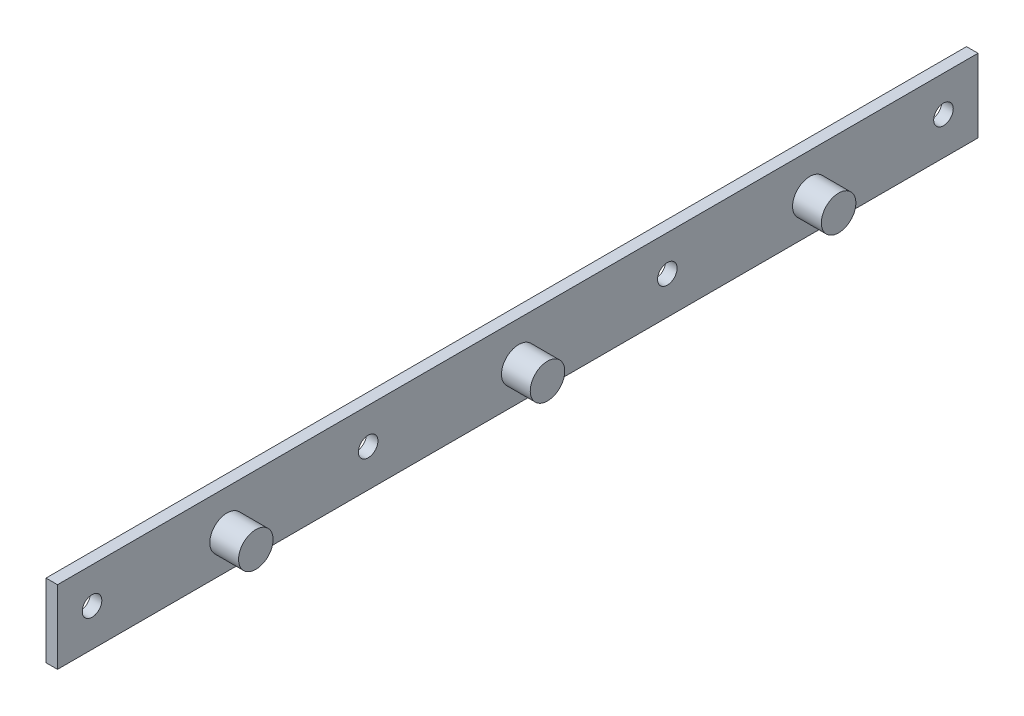
ISO-10303-21;
HEADER;
FILE_DESCRIPTION(('STEP AP214'),'2;1');
FILE_NAME('part.step','',(''),(''),'','','');
FILE_SCHEMA(('AUTOMOTIVE_DESIGN { 1 0 10303 214 1 1 1 1 }'));
ENDSEC;
DATA;
#1=APPLICATION_CONTEXT('core data for automotive mechanical design processes');
#2=APPLICATION_PROTOCOL_DEFINITION('international standard','automotive_design',2000,#1);
#3=PRODUCT_CONTEXT('',#1,'mechanical');
#4=PRODUCT('Part','Part','',(#3));
#5=PRODUCT_RELATED_PRODUCT_CATEGORY('part','',(#4));
#6=PRODUCT_DEFINITION_FORMATION('','',#4);
#7=PRODUCT_DEFINITION_CONTEXT('part definition',#1,'design');
#8=PRODUCT_DEFINITION('design','',#6,#7);
#9=PRODUCT_DEFINITION_SHAPE('','',#8);
#10=(LENGTH_UNIT() NAMED_UNIT(*) SI_UNIT(.MILLI.,.METRE.));
#11=(NAMED_UNIT(*) PLANE_ANGLE_UNIT() SI_UNIT($,.RADIAN.));
#12=(NAMED_UNIT(*) SI_UNIT($,.STERADIAN.) SOLID_ANGLE_UNIT());
#13=UNCERTAINTY_MEASURE_WITH_UNIT(LENGTH_MEASURE(1.E-05),#10,'distance_accuracy_value','');
#14=(GEOMETRIC_REPRESENTATION_CONTEXT(3) GLOBAL_UNCERTAINTY_ASSIGNED_CONTEXT((#13)) GLOBAL_UNIT_ASSIGNED_CONTEXT((#10,
#11,#12)) REPRESENTATION_CONTEXT('',''));
#15=CARTESIAN_POINT('',(0.,0.,0.));
#16=DIRECTION('',(0.,0.,1.));
#17=DIRECTION('',(1.,0.,0.));
#18=AXIS2_PLACEMENT_3D('',#15,#16,#17);
#19=CARTESIAN_POINT('',(2.,0.,0.));
#20=DIRECTION('',(-1.,0.,0.));
#21=DIRECTION('',(0.,0.,1.));
#22=AXIS2_PLACEMENT_3D('',#19,#20,#21);
#23=PLANE('',#22);
#24=CARTESIAN_POINT('',(2.,-0.555,-50.77));
#25=DIRECTION('',(-1.,0.,0.));
#26=DIRECTION('',(0.,0.,1.));
#27=AXIS2_PLACEMENT_3D('',#24,#25,#26);
#28=CIRCLE('',#27,3.);
#29=CARTESIAN_POINT('',(2.,-0.555,-47.77));
#30=VERTEX_POINT('',#29);
#31=EDGE_CURVE('E44',#30,#30,#28,.F.);
#32=ORIENTED_EDGE('',*,*,#31,.F.);
#33=EDGE_LOOP('',(#32));
#34=FACE_BOUND('',#33,.T.);
#35=CARTESIAN_POINT('',(2.,0.174999999999999,-74.));
#36=DIRECTION('',(1.,0.,0.));
#37=DIRECTION('',(0.,0.,-1.));
#38=AXIS2_PLACEMENT_3D('',#35,#36,#37);
#39=CIRCLE('',#38,1.7);
#40=CARTESIAN_POINT('',(2.,0.174999999999999,-75.7));
#41=VERTEX_POINT('',#40);
#42=EDGE_CURVE('E127',#41,#41,#39,.T.);
#43=ORIENTED_EDGE('',*,*,#42,.F.);
#44=EDGE_LOOP('',(#43));
#45=FACE_BOUND('',#44,.T.);
#46=CARTESIAN_POINT('',(2.,0.174999999999999,26.));
#47=DIRECTION('',(1.,0.,0.));
#48=DIRECTION('',(0.,0.,-1.));
#49=AXIS2_PLACEMENT_3D('',#46,#47,#48);
#50=CIRCLE('',#49,1.7);
#51=CARTESIAN_POINT('',(2.,0.174999999999999,24.3));
#52=VERTEX_POINT('',#51);
#53=EDGE_CURVE('E130',#52,#52,#50,.T.);
#54=ORIENTED_EDGE('',*,*,#53,.F.);
#55=EDGE_LOOP('',(#54));
#56=FACE_BOUND('',#55,.T.);
#57=DIRECTION('',(0.,1.,0.));
#58=VECTOR('',#57,1.);
#59=CARTESIAN_POINT('',(2.,-6.375,-80.));
#60=LINE('',#59,#58);
#61=CARTESIAN_POINT('',(2.,-6.375,-80.));
#62=VERTEX_POINT('',#61);
#63=CARTESIAN_POINT('',(2.,6.375,-80.));
#64=VERTEX_POINT('',#63);
#65=EDGE_CURVE('E88',#62,#64,#60,.T.);
#66=ORIENTED_EDGE('',*,*,#65,.T.);
#67=DIRECTION('',(0.,0.,1.));
#68=VECTOR('',#67,1.);
#69=CARTESIAN_POINT('',(2.,6.375,80.));
#70=LINE('',#69,#68);
#71=CARTESIAN_POINT('',(2.,6.375,80.));
#72=VERTEX_POINT('',#71);
#73=EDGE_CURVE('E83',#64,#72,#70,.T.);
#74=ORIENTED_EDGE('',*,*,#73,.T.);
#75=DIRECTION('',(0.,-1.,0.));
#76=VECTOR('',#75,1.);
#77=CARTESIAN_POINT('',(2.,-6.375,80.));
#78=LINE('',#77,#76);
#79=CARTESIAN_POINT('',(2.,-6.375,80.));
#80=VERTEX_POINT('',#79);
#81=EDGE_CURVE('E86',#72,#80,#78,.T.);
#82=ORIENTED_EDGE('',*,*,#81,.T.);
#83=DIRECTION('',(0.,0.,-1.));
#84=VECTOR('',#83,1.);
#85=CARTESIAN_POINT('',(2.,-6.375,80.));
#86=LINE('',#85,#84);
#87=EDGE_CURVE('E52',#80,#62,#86,.T.);
#88=ORIENTED_EDGE('',*,*,#87,.T.);
#89=EDGE_LOOP('',(#66,#74,#82,#88));
#90=FACE_BOUND('',#89,.T.);
#91=CARTESIAN_POINT('',(2.,0.174999999999999,74.));
#92=DIRECTION('',(1.,0.,0.));
#93=DIRECTION('',(0.,0.,-1.));
#94=AXIS2_PLACEMENT_3D('',#91,#92,#93);
#95=CIRCLE('',#94,1.7);
#96=CARTESIAN_POINT('',(2.,0.174999999999999,72.3));
#97=VERTEX_POINT('',#96);
#98=EDGE_CURVE('E106',#97,#97,#95,.T.);
#99=ORIENTED_EDGE('',*,*,#98,.F.);
#100=EDGE_LOOP('',(#99));
#101=FACE_BOUND('',#100,.T.);
#102=CARTESIAN_POINT('',(2.,0.174999999999999,-26.));
#103=DIRECTION('',(1.,0.,0.));
#104=DIRECTION('',(0.,0.,-1.));
#105=AXIS2_PLACEMENT_3D('',#102,#103,#104);
#106=CIRCLE('',#105,1.7);
#107=CARTESIAN_POINT('',(2.,0.174999999999999,-27.7));
#108=VERTEX_POINT('',#107);
#109=EDGE_CURVE('E138',#108,#108,#106,.T.);
#110=ORIENTED_EDGE('',*,*,#109,.F.);
#111=EDGE_LOOP('',(#110));
#112=FACE_BOUND('',#111,.T.);
#113=CARTESIAN_POINT('',(2.,-0.555,-0.170000000000003));
#114=DIRECTION('',(-1.,0.,0.));
#115=DIRECTION('',(0.,0.,1.));
#116=AXIS2_PLACEMENT_3D('',#113,#114,#115);
#117=CIRCLE('',#116,3.);
#118=CARTESIAN_POINT('',(2.,-0.555,2.83));
#119=VERTEX_POINT('',#118);
#120=EDGE_CURVE('E113',#119,#119,#117,.F.);
#121=ORIENTED_EDGE('',*,*,#120,.F.);
#122=EDGE_LOOP('',(#121));
#123=FACE_BOUND('',#122,.T.);
#124=CARTESIAN_POINT('',(2.,-0.555,50.53));
#125=DIRECTION('',(-1.,0.,0.));
#126=DIRECTION('',(0.,0.,1.));
#127=AXIS2_PLACEMENT_3D('',#124,#125,#126);
#128=CIRCLE('',#127,3.);
#129=CARTESIAN_POINT('',(2.,-0.555,53.53));
#130=VERTEX_POINT('',#129);
#131=EDGE_CURVE('E11',#130,#130,#128,.F.);
#132=ORIENTED_EDGE('',*,*,#131,.F.);
#133=EDGE_LOOP('',(#132));
#134=FACE_BOUND('',#133,.T.);
#135=ADVANCED_FACE('F35',(#34,#45,#56,#90,#101,#112,#123,#134),#23,.F.);
#136=CARTESIAN_POINT('',(0.,0.,0.));
#137=DIRECTION('',(-1.,0.,0.));
#138=DIRECTION('',(0.,0.,1.));
#139=AXIS2_PLACEMENT_3D('',#136,#137,#138);
#140=PLANE('',#139);
#141=CARTESIAN_POINT('',(0.,0.174999999999999,-26.));
#142=DIRECTION('',(1.,0.,0.));
#143=DIRECTION('',(0.,0.,-1.));
#144=AXIS2_PLACEMENT_3D('',#141,#142,#143);
#145=CIRCLE('',#144,1.7);
#146=CARTESIAN_POINT('',(0.,0.174999999999999,-27.7));
#147=VERTEX_POINT('',#146);
#148=EDGE_CURVE('E141',#147,#147,#145,.T.);
#149=ORIENTED_EDGE('',*,*,#148,.T.);
#150=EDGE_LOOP('',(#149));
#151=FACE_BOUND('',#150,.T.);
#152=CARTESIAN_POINT('',(0.,0.174999999999999,74.));
#153=DIRECTION('',(1.,0.,0.));
#154=DIRECTION('',(0.,0.,-1.));
#155=AXIS2_PLACEMENT_3D('',#152,#153,#154);
#156=CIRCLE('',#155,1.7);
#157=CARTESIAN_POINT('',(0.,0.174999999999999,72.3));
#158=VERTEX_POINT('',#157);
#159=EDGE_CURVE('E132',#158,#158,#156,.T.);
#160=ORIENTED_EDGE('',*,*,#159,.T.);
#161=EDGE_LOOP('',(#160));
#162=FACE_BOUND('',#161,.T.);
#163=DIRECTION('',(0.,1.,0.));
#164=VECTOR('',#163,1.);
#165=CARTESIAN_POINT('',(0.,-6.375,-80.));
#166=LINE('',#165,#164);
#167=CARTESIAN_POINT('',(0.,-6.375,-80.));
#168=VERTEX_POINT('',#167);
#169=CARTESIAN_POINT('',(0.,6.375,-80.));
#170=VERTEX_POINT('',#169);
#171=EDGE_CURVE('E103',#168,#170,#166,.T.);
#172=ORIENTED_EDGE('',*,*,#171,.F.);
#173=DIRECTION('',(0.,0.,-1.));
#174=VECTOR('',#173,1.);
#175=CARTESIAN_POINT('',(0.,-6.375,80.));
#176=LINE('',#175,#174);
#177=CARTESIAN_POINT('',(0.,-6.375,80.));
#178=VERTEX_POINT('',#177);
#179=EDGE_CURVE('E75',#178,#168,#176,.T.);
#180=ORIENTED_EDGE('',*,*,#179,.F.);
#181=DIRECTION('',(0.,-1.,0.));
#182=VECTOR('',#181,1.);
#183=CARTESIAN_POINT('',(0.,-6.375,80.));
#184=LINE('',#183,#182);
#185=CARTESIAN_POINT('',(0.,6.375,80.));
#186=VERTEX_POINT('',#185);
#187=EDGE_CURVE('E69',#186,#178,#184,.T.);
#188=ORIENTED_EDGE('',*,*,#187,.F.);
#189=DIRECTION('',(0.,0.,1.));
#190=VECTOR('',#189,1.);
#191=CARTESIAN_POINT('',(0.,6.375,80.));
#192=LINE('',#191,#190);
#193=EDGE_CURVE('E93',#170,#186,#192,.T.);
#194=ORIENTED_EDGE('',*,*,#193,.F.);
#195=EDGE_LOOP('',(#172,#180,#188,#194));
#196=FACE_BOUND('',#195,.T.);
#197=CARTESIAN_POINT('',(0.,0.174999999999999,26.));
#198=DIRECTION('',(1.,0.,0.));
#199=DIRECTION('',(0.,0.,-1.));
#200=AXIS2_PLACEMENT_3D('',#197,#198,#199);
#201=CIRCLE('',#200,1.7);
#202=CARTESIAN_POINT('',(0.,0.174999999999999,24.3));
#203=VERTEX_POINT('',#202);
#204=EDGE_CURVE('E133',#203,#203,#201,.T.);
#205=ORIENTED_EDGE('',*,*,#204,.T.);
#206=EDGE_LOOP('',(#205));
#207=FACE_BOUND('',#206,.T.);
#208=CARTESIAN_POINT('',(0.,0.174999999999999,-74.));
#209=DIRECTION('',(1.,0.,0.));
#210=DIRECTION('',(0.,0.,-1.));
#211=AXIS2_PLACEMENT_3D('',#208,#209,#210);
#212=CIRCLE('',#211,1.7);
#213=CARTESIAN_POINT('',(0.,0.174999999999999,-75.7));
#214=VERTEX_POINT('',#213);
#215=EDGE_CURVE('E218',#214,#214,#212,.T.);
#216=ORIENTED_EDGE('',*,*,#215,.T.);
#217=EDGE_LOOP('',(#216));
#218=FACE_BOUND('',#217,.T.);
#219=ADVANCED_FACE('F122',(#151,#162,#196,#207,#218),#140,.T.);
#220=CARTESIAN_POINT('',(2.,-6.375,-80.));
#221=DIRECTION('',(0.,0.,1.));
#222=DIRECTION('',(1.,0.,0.));
#223=AXIS2_PLACEMENT_3D('',#220,#221,#222);
#224=PLANE('',#223);
#225=ORIENTED_EDGE('',*,*,#171,.T.);
#226=DIRECTION('',(-1.,0.,0.));
#227=VECTOR('',#226,1.);
#228=CARTESIAN_POINT('',(2.,6.375,-80.));
#229=LINE('',#228,#227);
#230=EDGE_CURVE('E94',#64,#170,#229,.T.);
#231=ORIENTED_EDGE('',*,*,#230,.F.);
#232=ORIENTED_EDGE('',*,*,#65,.F.);
#233=DIRECTION('',(-1.,0.,0.));
#234=VECTOR('',#233,1.);
#235=CARTESIAN_POINT('',(2.,-6.375,-80.));
#236=LINE('',#235,#234);
#237=EDGE_CURVE('E99',#62,#168,#236,.T.);
#238=ORIENTED_EDGE('',*,*,#237,.T.);
#239=EDGE_LOOP('',(#225,#231,#232,#238));
#240=FACE_BOUND('',#239,.T.);
#241=ADVANCED_FACE('F37',(#240),#224,.F.);
#242=CARTESIAN_POINT('',(2.,6.375,80.));
#243=DIRECTION('',(0.,-1.,0.));
#244=DIRECTION('',(0.,0.,-1.));
#245=AXIS2_PLACEMENT_3D('',#242,#243,#244);
#246=PLANE('',#245);
#247=ORIENTED_EDGE('',*,*,#193,.T.);
#248=DIRECTION('',(-1.,0.,0.));
#249=VECTOR('',#248,1.);
#250=CARTESIAN_POINT('',(2.,6.375,80.));
#251=LINE('',#250,#249);
#252=EDGE_CURVE('E91',#72,#186,#251,.T.);
#253=ORIENTED_EDGE('',*,*,#252,.F.);
#254=ORIENTED_EDGE('',*,*,#73,.F.);
#255=ORIENTED_EDGE('',*,*,#230,.T.);
#256=EDGE_LOOP('',(#247,#253,#254,#255));
#257=FACE_BOUND('',#256,.T.);
#258=ADVANCED_FACE('F92',(#257),#246,.F.);
#259=CARTESIAN_POINT('',(2.,-6.375,80.));
#260=DIRECTION('',(0.,0.,-1.));
#261=DIRECTION('',(-1.,0.,0.));
#262=AXIS2_PLACEMENT_3D('',#259,#260,#261);
#263=PLANE('',#262);
#264=ORIENTED_EDGE('',*,*,#187,.T.);
#265=DIRECTION('',(-1.,0.,0.));
#266=VECTOR('',#265,1.);
#267=CARTESIAN_POINT('',(2.,-6.375,80.));
#268=LINE('',#267,#266);
#269=EDGE_CURVE('E95',#80,#178,#268,.T.);
#270=ORIENTED_EDGE('',*,*,#269,.F.);
#271=ORIENTED_EDGE('',*,*,#81,.F.);
#272=ORIENTED_EDGE('',*,*,#252,.T.);
#273=EDGE_LOOP('',(#264,#270,#271,#272));
#274=FACE_BOUND('',#273,.T.);
#275=ADVANCED_FACE('F97',(#274),#263,.F.);
#276=CARTESIAN_POINT('',(2.,-6.375,80.));
#277=DIRECTION('',(0.,1.,0.));
#278=DIRECTION('',(0.,0.,1.));
#279=AXIS2_PLACEMENT_3D('',#276,#277,#278);
#280=PLANE('',#279);
#281=ORIENTED_EDGE('',*,*,#179,.T.);
#282=ORIENTED_EDGE('',*,*,#237,.F.);
#283=ORIENTED_EDGE('',*,*,#87,.F.);
#284=ORIENTED_EDGE('',*,*,#269,.T.);
#285=EDGE_LOOP('',(#281,#282,#283,#284));
#286=FACE_BOUND('',#285,.T.);
#287=ADVANCED_FACE('F196',(#286),#280,.F.);
#288=CARTESIAN_POINT('',(2.,0.174999999999999,74.));
#289=DIRECTION('',(-1.,0.,0.));
#290=DIRECTION('',(0.,0.,1.));
#291=AXIS2_PLACEMENT_3D('',#288,#289,#290);
#292=CYLINDRICAL_SURFACE('',#291,1.7);
#293=ORIENTED_EDGE('',*,*,#98,.T.);
#294=EDGE_LOOP('',(#293));
#295=FACE_BOUND('',#294,.T.);
#296=ORIENTED_EDGE('',*,*,#159,.F.);
#297=EDGE_LOOP('',(#296));
#298=FACE_BOUND('',#297,.T.);
#299=ADVANCED_FACE('F147',(#295,#298),#292,.F.);
#300=CARTESIAN_POINT('',(2.,0.174999999999999,26.));
#301=DIRECTION('',(-1.,0.,0.));
#302=DIRECTION('',(0.,0.,1.));
#303=AXIS2_PLACEMENT_3D('',#300,#301,#302);
#304=CYLINDRICAL_SURFACE('',#303,1.7);
#305=ORIENTED_EDGE('',*,*,#53,.T.);
#306=EDGE_LOOP('',(#305));
#307=FACE_BOUND('',#306,.T.);
#308=ORIENTED_EDGE('',*,*,#204,.F.);
#309=EDGE_LOOP('',(#308));
#310=FACE_BOUND('',#309,.T.);
#311=ADVANCED_FACE('F191',(#307,#310),#304,.F.);
#312=CARTESIAN_POINT('',(2.,0.174999999999999,-26.));
#313=DIRECTION('',(-1.,0.,0.));
#314=DIRECTION('',(0.,0.,1.));
#315=AXIS2_PLACEMENT_3D('',#312,#313,#314);
#316=CYLINDRICAL_SURFACE('',#315,1.7);
#317=ORIENTED_EDGE('',*,*,#109,.T.);
#318=EDGE_LOOP('',(#317));
#319=FACE_BOUND('',#318,.T.);
#320=ORIENTED_EDGE('',*,*,#148,.F.);
#321=EDGE_LOOP('',(#320));
#322=FACE_BOUND('',#321,.T.);
#323=ADVANCED_FACE('F187',(#319,#322),#316,.F.);
#324=CARTESIAN_POINT('',(2.,0.174999999999999,-74.));
#325=DIRECTION('',(-1.,0.,0.));
#326=DIRECTION('',(0.,0.,1.));
#327=AXIS2_PLACEMENT_3D('',#324,#325,#326);
#328=CYLINDRICAL_SURFACE('',#327,1.7);
#329=ORIENTED_EDGE('',*,*,#42,.T.);
#330=EDGE_LOOP('',(#329));
#331=FACE_BOUND('',#330,.T.);
#332=ORIENTED_EDGE('',*,*,#215,.F.);
#333=EDGE_LOOP('',(#332));
#334=FACE_BOUND('',#333,.T.);
#335=ADVANCED_FACE('F183',(#331,#334),#328,.F.);
#336=CARTESIAN_POINT('',(7.,-0.555,-0.170000000000003));
#337=DIRECTION('',(-1.,0.,0.));
#338=DIRECTION('',(0.,0.,1.));
#339=AXIS2_PLACEMENT_3D('',#336,#337,#338);
#340=CYLINDRICAL_SURFACE('',#339,3.);
#341=CARTESIAN_POINT('',(7.,-0.555,-0.170000000000003));
#342=DIRECTION('',(1.,0.,0.));
#343=DIRECTION('',(0.,0.,-1.));
#344=AXIS2_PLACEMENT_3D('',#341,#342,#343);
#345=CIRCLE('',#344,3.);
#346=CARTESIAN_POINT('',(7.,-0.555,-3.17));
#347=VERTEX_POINT('',#346);
#348=EDGE_CURVE('E220',#347,#347,#345,.T.);
#349=ORIENTED_EDGE('',*,*,#348,.F.);
#350=EDGE_LOOP('',(#349));
#351=FACE_BOUND('',#350,.T.);
#352=ORIENTED_EDGE('',*,*,#120,.T.);
#353=EDGE_LOOP('',(#352));
#354=FACE_BOUND('',#353,.T.);
#355=ADVANCED_FACE('F179',(#351,#354),#340,.T.);
#356=CARTESIAN_POINT('',(7.,-0.555,-0.170000000000003));
#357=DIRECTION('',(1.,0.,0.));
#358=DIRECTION('',(0.,0.,-1.));
#359=AXIS2_PLACEMENT_3D('',#356,#357,#358);
#360=PLANE('',#359);
#361=ORIENTED_EDGE('',*,*,#348,.T.);
#362=EDGE_LOOP('',(#361));
#363=FACE_BOUND('',#362,.T.);
#364=ADVANCED_FACE('F175',(#363),#360,.T.);
#365=CARTESIAN_POINT('',(7.,-0.555,-50.77));
#366=DIRECTION('',(-1.,0.,0.));
#367=DIRECTION('',(0.,0.,1.));
#368=AXIS2_PLACEMENT_3D('',#365,#366,#367);
#369=CYLINDRICAL_SURFACE('',#368,3.);
#370=CARTESIAN_POINT('',(7.,-0.555,-50.77));
#371=DIRECTION('',(1.,0.,0.));
#372=DIRECTION('',(0.,0.,-1.));
#373=AXIS2_PLACEMENT_3D('',#370,#371,#372);
#374=CIRCLE('',#373,3.);
#375=CARTESIAN_POINT('',(7.,-0.555,-53.77));
#376=VERTEX_POINT('',#375);
#377=EDGE_CURVE('E224',#376,#376,#374,.T.);
#378=ORIENTED_EDGE('',*,*,#377,.F.);
#379=EDGE_LOOP('',(#378));
#380=FACE_BOUND('',#379,.T.);
#381=ORIENTED_EDGE('',*,*,#31,.T.);
#382=EDGE_LOOP('',(#381));
#383=FACE_BOUND('',#382,.T.);
#384=ADVANCED_FACE('F118',(#380,#383),#369,.T.);
#385=CARTESIAN_POINT('',(7.,-0.555,-50.77));
#386=DIRECTION('',(1.,0.,0.));
#387=DIRECTION('',(0.,0.,-1.));
#388=AXIS2_PLACEMENT_3D('',#385,#386,#387);
#389=PLANE('',#388);
#390=ORIENTED_EDGE('',*,*,#377,.T.);
#391=EDGE_LOOP('',(#390));
#392=FACE_BOUND('',#391,.T.);
#393=ADVANCED_FACE('F160',(#392),#389,.T.);
#394=CARTESIAN_POINT('',(7.,-0.555,50.53));
#395=DIRECTION('',(-1.,0.,0.));
#396=DIRECTION('',(0.,0.,1.));
#397=AXIS2_PLACEMENT_3D('',#394,#395,#396);
#398=CYLINDRICAL_SURFACE('',#397,3.);
#399=CARTESIAN_POINT('',(7.,-0.555,50.53));
#400=DIRECTION('',(1.,0.,0.));
#401=DIRECTION('',(0.,0.,-1.));
#402=AXIS2_PLACEMENT_3D('',#399,#400,#401);
#403=CIRCLE('',#402,3.);
#404=CARTESIAN_POINT('',(7.,-0.555,47.53));
#405=VERTEX_POINT('',#404);
#406=EDGE_CURVE('E234',#405,#405,#403,.T.);
#407=ORIENTED_EDGE('',*,*,#406,.F.);
#408=EDGE_LOOP('',(#407));
#409=FACE_BOUND('',#408,.T.);
#410=ORIENTED_EDGE('',*,*,#131,.T.);
#411=EDGE_LOOP('',(#410));
#412=FACE_BOUND('',#411,.T.);
#413=ADVANCED_FACE('F157',(#409,#412),#398,.T.);
#414=CARTESIAN_POINT('',(7.,-0.555,50.53));
#415=DIRECTION('',(1.,0.,0.));
#416=DIRECTION('',(0.,0.,-1.));
#417=AXIS2_PLACEMENT_3D('',#414,#415,#416);
#418=PLANE('',#417);
#419=ORIENTED_EDGE('',*,*,#406,.T.);
#420=EDGE_LOOP('',(#419));
#421=FACE_BOUND('',#420,.T.);
#422=ADVANCED_FACE('F159',(#421),#418,.T.);
#423=CLOSED_SHELL('',(#135,#219,#241,#258,#275,#287,#299,#311,#323,#335,#355,#364,#384,#393,
#413,#422));
#424=MANIFOLD_SOLID_BREP('B2',#423);
#425=ADVANCED_BREP_SHAPE_REPRESENTATION('',(#18,#424),#14);
#426=SHAPE_DEFINITION_REPRESENTATION(#9,#425);
ENDSEC;
END-ISO-10303-21;
